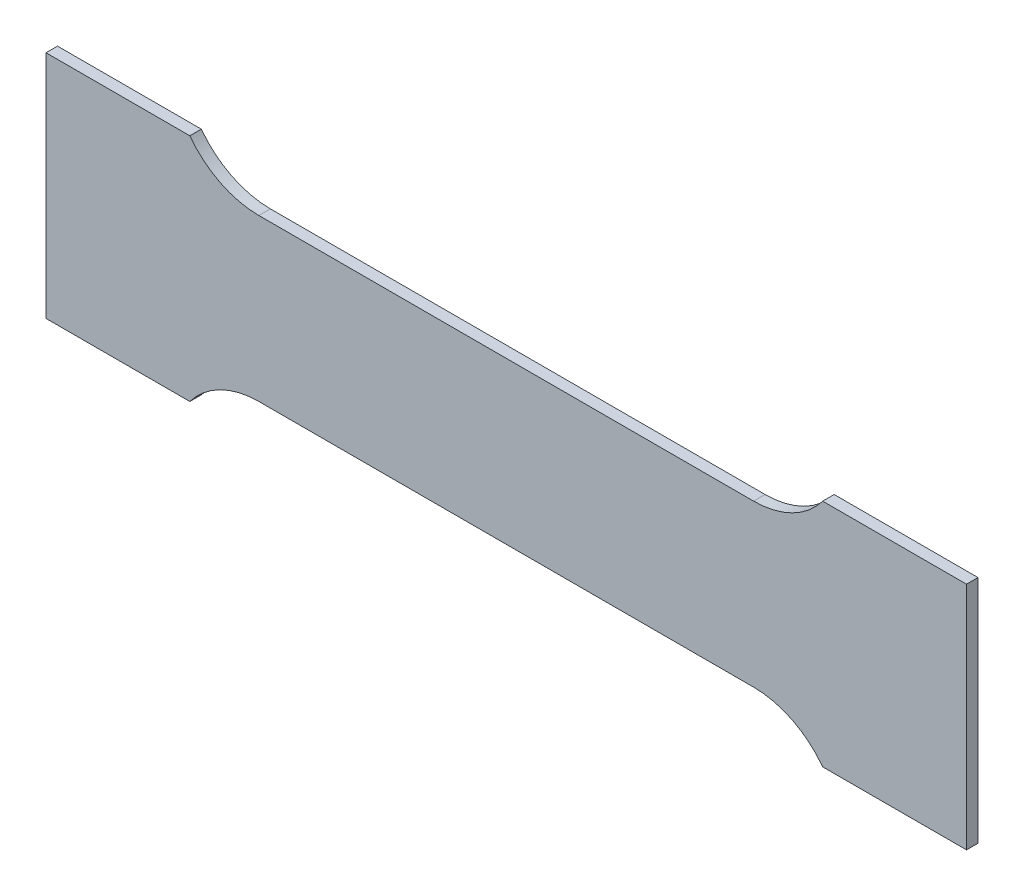
ISO-10303-21;
HEADER;
FILE_DESCRIPTION(('STEP AP214'),'2;1');
FILE_NAME('part.step','',(''),(''),'','','');
FILE_SCHEMA(('AUTOMOTIVE_DESIGN { 1 0 10303 214 1 1 1 1 }'));
ENDSEC;
DATA;
#1=APPLICATION_CONTEXT('core data for automotive mechanical design processes');
#2=APPLICATION_PROTOCOL_DEFINITION('international standard','automotive_design',2000,#1);
#3=PRODUCT_CONTEXT('',#1,'mechanical');
#4=PRODUCT('Part','Part','',(#3));
#5=PRODUCT_RELATED_PRODUCT_CATEGORY('part','',(#4));
#6=PRODUCT_DEFINITION_FORMATION('','',#4);
#7=PRODUCT_DEFINITION_CONTEXT('part definition',#1,'design');
#8=PRODUCT_DEFINITION('design','',#6,#7);
#9=PRODUCT_DEFINITION_SHAPE('','',#8);
#10=(LENGTH_UNIT() NAMED_UNIT(*) SI_UNIT(.MILLI.,.METRE.));
#11=(NAMED_UNIT(*) PLANE_ANGLE_UNIT() SI_UNIT($,.RADIAN.));
#12=(NAMED_UNIT(*) SI_UNIT($,.STERADIAN.) SOLID_ANGLE_UNIT());
#13=UNCERTAINTY_MEASURE_WITH_UNIT(LENGTH_MEASURE(1.E-05),#10,'distance_accuracy_value','');
#14=(GEOMETRIC_REPRESENTATION_CONTEXT(3) GLOBAL_UNCERTAINTY_ASSIGNED_CONTEXT((#13)) GLOBAL_UNIT_ASSIGNED_CONTEXT((#10,
#11,#12)) REPRESENTATION_CONTEXT('',''));
#15=CARTESIAN_POINT('',(0.,0.,0.));
#16=DIRECTION('',(0.,0.,1.));
#17=DIRECTION('',(1.,0.,0.));
#18=AXIS2_PLACEMENT_3D('',#15,#16,#17);
#19=CARTESIAN_POINT('',(43.,29.,-2.));
#20=DIRECTION('',(0.,0.,1.));
#21=DIRECTION('',(1.,0.,0.));
#22=AXIS2_PLACEMENT_3D('',#19,#20,#21);
#23=CYLINDRICAL_SURFACE('',#22,15.);
#24=CARTESIAN_POINT('',(43.,29.,0.));
#25=DIRECTION('',(0.,0.,-1.));
#26=DIRECTION('',(1.,0.,0.));
#27=AXIS2_PLACEMENT_3D('',#24,#25,#26);
#28=CIRCLE('',#27,15.);
#29=CARTESIAN_POINT('',(55.,20.,0.));
#30=VERTEX_POINT('',#29);
#31=CARTESIAN_POINT('',(43.,14.,0.));
#32=VERTEX_POINT('',#31);
#33=EDGE_CURVE('E158',#30,#32,#28,.T.);
#34=ORIENTED_EDGE('',*,*,#33,.F.);
#35=DIRECTION('',(0.,0.,1.));
#36=VECTOR('',#35,1.);
#37=CARTESIAN_POINT('',(55.,20.,-2.));
#38=LINE('',#37,#36);
#39=CARTESIAN_POINT('',(55.,20.,-2.));
#40=VERTEX_POINT('',#39);
#41=EDGE_CURVE('E11',#40,#30,#38,.T.);
#42=ORIENTED_EDGE('',*,*,#41,.F.);
#43=CARTESIAN_POINT('',(43.,29.,-2.));
#44=DIRECTION('',(0.,0.,-1.));
#45=DIRECTION('',(1.,0.,0.));
#46=AXIS2_PLACEMENT_3D('',#43,#44,#45);
#47=CIRCLE('',#46,15.);
#48=CARTESIAN_POINT('',(43.,14.,-2.));
#49=VERTEX_POINT('',#48);
#50=EDGE_CURVE('E190',#40,#49,#47,.T.);
#51=ORIENTED_EDGE('',*,*,#50,.T.);
#52=DIRECTION('',(0.,0.,1.));
#53=VECTOR('',#52,1.);
#54=CARTESIAN_POINT('',(43.,14.,-2.));
#55=LINE('',#54,#53);
#56=EDGE_CURVE('E40',#49,#32,#55,.T.);
#57=ORIENTED_EDGE('',*,*,#56,.T.);
#58=EDGE_LOOP('',(#34,#42,#51,#57));
#59=FACE_BOUND('',#58,.T.);
#60=ADVANCED_FACE('F37',(#59),#23,.F.);
#61=CARTESIAN_POINT('',(55.,20.,-2.));
#62=DIRECTION('',(0.,1.,0.));
#63=DIRECTION('',(0.,0.,1.));
#64=AXIS2_PLACEMENT_3D('',#61,#62,#63);
#65=PLANE('',#64);
#66=DIRECTION('',(-1.,0.,0.));
#67=VECTOR('',#66,1.);
#68=CARTESIAN_POINT('',(55.,20.,0.));
#69=LINE('',#68,#67);
#70=CARTESIAN_POINT('',(80.,20.,0.));
#71=VERTEX_POINT('',#70);
#72=EDGE_CURVE('E188',#71,#30,#69,.T.);
#73=ORIENTED_EDGE('',*,*,#72,.F.);
#74=DIRECTION('',(0.,0.,1.));
#75=VECTOR('',#74,1.);
#76=CARTESIAN_POINT('',(80.,20.,-2.));
#77=LINE('',#76,#75);
#78=CARTESIAN_POINT('',(80.,20.,-2.));
#79=VERTEX_POINT('',#78);
#80=EDGE_CURVE('E46',#79,#71,#77,.T.);
#81=ORIENTED_EDGE('',*,*,#80,.F.);
#82=DIRECTION('',(-1.,0.,0.));
#83=VECTOR('',#82,1.);
#84=CARTESIAN_POINT('',(55.,20.,-2.));
#85=LINE('',#84,#83);
#86=EDGE_CURVE('E148',#79,#40,#85,.T.);
#87=ORIENTED_EDGE('',*,*,#86,.T.);
#88=ORIENTED_EDGE('',*,*,#41,.T.);
#89=EDGE_LOOP('',(#73,#81,#87,#88));
#90=FACE_BOUND('',#89,.T.);
#91=ADVANCED_FACE('F210',(#90),#65,.T.);
#92=CARTESIAN_POINT('',(80.,20.,-2.));
#93=DIRECTION('',(1.,0.,0.));
#94=DIRECTION('',(0.,1.,0.));
#95=AXIS2_PLACEMENT_3D('',#92,#93,#94);
#96=PLANE('',#95);
#97=DIRECTION('',(0.,1.,0.));
#98=VECTOR('',#97,1.);
#99=CARTESIAN_POINT('',(80.,20.,0.));
#100=LINE('',#99,#98);
#101=CARTESIAN_POINT('',(79.9999999999999,-20.,0.));
#102=VERTEX_POINT('',#101);
#103=EDGE_CURVE('E135',#102,#71,#100,.T.);
#104=ORIENTED_EDGE('',*,*,#103,.F.);
#105=DIRECTION('',(0.,0.,1.));
#106=VECTOR('',#105,1.);
#107=CARTESIAN_POINT('',(79.9999999999999,-20.,-2.));
#108=LINE('',#107,#106);
#109=CARTESIAN_POINT('',(79.9999999999999,-20.,-2.));
#110=VERTEX_POINT('',#109);
#111=EDGE_CURVE('E130',#110,#102,#108,.T.);
#112=ORIENTED_EDGE('',*,*,#111,.F.);
#113=DIRECTION('',(0.,1.,0.));
#114=VECTOR('',#113,1.);
#115=CARTESIAN_POINT('',(80.,20.,-2.));
#116=LINE('',#115,#114);
#117=EDGE_CURVE('E133',#110,#79,#116,.T.);
#118=ORIENTED_EDGE('',*,*,#117,.T.);
#119=ORIENTED_EDGE('',*,*,#80,.T.);
#120=EDGE_LOOP('',(#104,#112,#118,#119));
#121=FACE_BOUND('',#120,.T.);
#122=ADVANCED_FACE('F132',(#121),#96,.T.);
#123=CARTESIAN_POINT('',(54.9999999999999,-20.,-2.));
#124=DIRECTION('',(0.,-1.,0.));
#125=DIRECTION('',(0.,0.,-1.));
#126=AXIS2_PLACEMENT_3D('',#123,#124,#125);
#127=PLANE('',#126);
#128=DIRECTION('',(1.,0.,0.));
#129=VECTOR('',#128,1.);
#130=CARTESIAN_POINT('',(54.9999999999999,-20.,0.));
#131=LINE('',#130,#129);
#132=CARTESIAN_POINT('',(54.9999999999999,-20.,0.));
#133=VERTEX_POINT('',#132);
#134=EDGE_CURVE('E185',#133,#102,#131,.T.);
#135=ORIENTED_EDGE('',*,*,#134,.F.);
#136=DIRECTION('',(0.,0.,1.));
#137=VECTOR('',#136,1.);
#138=CARTESIAN_POINT('',(54.9999999999999,-20.,-2.));
#139=LINE('',#138,#137);
#140=CARTESIAN_POINT('',(54.9999999999999,-20.,-2.));
#141=VERTEX_POINT('',#140);
#142=EDGE_CURVE('E140',#141,#133,#139,.T.);
#143=ORIENTED_EDGE('',*,*,#142,.F.);
#144=DIRECTION('',(1.,0.,0.));
#145=VECTOR('',#144,1.);
#146=CARTESIAN_POINT('',(54.9999999999999,-20.,-2.));
#147=LINE('',#146,#145);
#148=EDGE_CURVE('E146',#141,#110,#147,.T.);
#149=ORIENTED_EDGE('',*,*,#148,.T.);
#150=ORIENTED_EDGE('',*,*,#111,.T.);
#151=EDGE_LOOP('',(#135,#143,#149,#150));
#152=FACE_BOUND('',#151,.T.);
#153=ADVANCED_FACE('F150',(#152),#127,.T.);
#154=CARTESIAN_POINT('',(42.9999999999999,-29.,-2.));
#155=DIRECTION('',(0.,0.,1.));
#156=DIRECTION('',(1.,0.,0.));
#157=AXIS2_PLACEMENT_3D('',#154,#155,#156);
#158=CYLINDRICAL_SURFACE('',#157,15.);
#159=CARTESIAN_POINT('',(42.9999999999999,-29.,0.));
#160=DIRECTION('',(0.,0.,-1.));
#161=DIRECTION('',(-1.,0.,0.));
#162=AXIS2_PLACEMENT_3D('',#159,#160,#161);
#163=CIRCLE('',#162,15.);
#164=CARTESIAN_POINT('',(42.9999999999999,-14.,0.));
#165=VERTEX_POINT('',#164);
#166=EDGE_CURVE('E182',#165,#133,#163,.T.);
#167=ORIENTED_EDGE('',*,*,#166,.F.);
#168=DIRECTION('',(0.,0.,1.));
#169=VECTOR('',#168,1.);
#170=CARTESIAN_POINT('',(42.9999999999999,-14.,-2.));
#171=LINE('',#170,#169);
#172=CARTESIAN_POINT('',(42.9999999999999,-14.,-2.));
#173=VERTEX_POINT('',#172);
#174=EDGE_CURVE('E194',#173,#165,#171,.T.);
#175=ORIENTED_EDGE('',*,*,#174,.F.);
#176=CARTESIAN_POINT('',(42.9999999999999,-29.,-2.));
#177=DIRECTION('',(0.,0.,-1.));
#178=DIRECTION('',(-1.,0.,0.));
#179=AXIS2_PLACEMENT_3D('',#176,#177,#178);
#180=CIRCLE('',#179,15.);
#181=EDGE_CURVE('E151',#173,#141,#180,.T.);
#182=ORIENTED_EDGE('',*,*,#181,.T.);
#183=ORIENTED_EDGE('',*,*,#142,.T.);
#184=EDGE_LOOP('',(#167,#175,#182,#183));
#185=FACE_BOUND('',#184,.T.);
#186=ADVANCED_FACE('F223',(#185),#158,.F.);
#187=CARTESIAN_POINT('',(-43.,-14.,-2.));
#188=DIRECTION('',(0.,-1.,0.));
#189=DIRECTION('',(0.,0.,-1.));
#190=AXIS2_PLACEMENT_3D('',#187,#188,#189);
#191=PLANE('',#190);
#192=DIRECTION('',(1.,0.,0.));
#193=VECTOR('',#192,1.);
#194=CARTESIAN_POINT('',(-43.,-14.,0.));
#195=LINE('',#194,#193);
#196=CARTESIAN_POINT('',(-43.,-14.,0.));
#197=VERTEX_POINT('',#196);
#198=EDGE_CURVE('E179',#197,#165,#195,.T.);
#199=ORIENTED_EDGE('',*,*,#198,.F.);
#200=DIRECTION('',(0.,0.,1.));
#201=VECTOR('',#200,1.);
#202=CARTESIAN_POINT('',(-43.,-14.,-2.));
#203=LINE('',#202,#201);
#204=CARTESIAN_POINT('',(-43.,-14.,-2.));
#205=VERTEX_POINT('',#204);
#206=EDGE_CURVE('E196',#205,#197,#203,.T.);
#207=ORIENTED_EDGE('',*,*,#206,.F.);
#208=DIRECTION('',(1.,0.,0.));
#209=VECTOR('',#208,1.);
#210=CARTESIAN_POINT('',(-43.,-14.,-2.));
#211=LINE('',#210,#209);
#212=EDGE_CURVE('E153',#205,#173,#211,.T.);
#213=ORIENTED_EDGE('',*,*,#212,.T.);
#214=ORIENTED_EDGE('',*,*,#174,.T.);
#215=EDGE_LOOP('',(#199,#207,#213,#214));
#216=FACE_BOUND('',#215,.T.);
#217=ADVANCED_FACE('F226',(#216),#191,.T.);
#218=CARTESIAN_POINT('',(-43.,-29.,-2.));
#219=DIRECTION('',(0.,0.,1.));
#220=DIRECTION('',(1.,0.,0.));
#221=AXIS2_PLACEMENT_3D('',#218,#219,#220);
#222=CYLINDRICAL_SURFACE('',#221,15.);
#223=CARTESIAN_POINT('',(-43.,-29.,0.));
#224=DIRECTION('',(0.,0.,-1.));
#225=DIRECTION('',(1.,0.,0.));
#226=AXIS2_PLACEMENT_3D('',#223,#224,#225);
#227=CIRCLE('',#226,15.);
#228=CARTESIAN_POINT('',(-55.,-20.,0.));
#229=VERTEX_POINT('',#228);
#230=EDGE_CURVE('E176',#229,#197,#227,.T.);
#231=ORIENTED_EDGE('',*,*,#230,.F.);
#232=DIRECTION('',(0.,0.,1.));
#233=VECTOR('',#232,1.);
#234=CARTESIAN_POINT('',(-55.,-20.,-2.));
#235=LINE('',#234,#233);
#236=CARTESIAN_POINT('',(-55.,-20.,-2.));
#237=VERTEX_POINT('',#236);
#238=EDGE_CURVE('E198',#237,#229,#235,.T.);
#239=ORIENTED_EDGE('',*,*,#238,.F.);
#240=CARTESIAN_POINT('',(-43.,-29.,-2.));
#241=DIRECTION('',(0.,0.,-1.));
#242=DIRECTION('',(1.,0.,0.));
#243=AXIS2_PLACEMENT_3D('',#240,#241,#242);
#244=CIRCLE('',#243,15.);
#245=EDGE_CURVE('E380',#237,#205,#244,.T.);
#246=ORIENTED_EDGE('',*,*,#245,.T.);
#247=ORIENTED_EDGE('',*,*,#206,.T.);
#248=EDGE_LOOP('',(#231,#239,#246,#247));
#249=FACE_BOUND('',#248,.T.);
#250=ADVANCED_FACE('F230',(#249),#222,.F.);
#251=CARTESIAN_POINT('',(-55.,-20.,-2.));
#252=DIRECTION('',(0.,-1.,0.));
#253=DIRECTION('',(0.,0.,-1.));
#254=AXIS2_PLACEMENT_3D('',#251,#252,#253);
#255=PLANE('',#254);
#256=DIRECTION('',(1.,0.,0.));
#257=VECTOR('',#256,1.);
#258=CARTESIAN_POINT('',(-55.,-20.,0.));
#259=LINE('',#258,#257);
#260=CARTESIAN_POINT('',(-80.,-20.,0.));
#261=VERTEX_POINT('',#260);
#262=EDGE_CURVE('E173',#261,#229,#259,.T.);
#263=ORIENTED_EDGE('',*,*,#262,.F.);
#264=DIRECTION('',(0.,0.,1.));
#265=VECTOR('',#264,1.);
#266=CARTESIAN_POINT('',(-80.,-20.,-2.));
#267=LINE('',#266,#265);
#268=CARTESIAN_POINT('',(-80.,-20.,-2.));
#269=VERTEX_POINT('',#268);
#270=EDGE_CURVE('E200',#269,#261,#267,.T.);
#271=ORIENTED_EDGE('',*,*,#270,.F.);
#272=DIRECTION('',(1.,0.,0.));
#273=VECTOR('',#272,1.);
#274=CARTESIAN_POINT('',(-55.,-20.,-2.));
#275=LINE('',#274,#273);
#276=EDGE_CURVE('E384',#269,#237,#275,.T.);
#277=ORIENTED_EDGE('',*,*,#276,.T.);
#278=ORIENTED_EDGE('',*,*,#238,.T.);
#279=EDGE_LOOP('',(#263,#271,#277,#278));
#280=FACE_BOUND('',#279,.T.);
#281=ADVANCED_FACE('F234',(#280),#255,.T.);
#282=CARTESIAN_POINT('',(-80.,20.,-2.));
#283=DIRECTION('',(-1.,0.,0.));
#284=DIRECTION('',(0.,0.,1.));
#285=AXIS2_PLACEMENT_3D('',#282,#283,#284);
#286=PLANE('',#285);
#287=DIRECTION('',(0.,-1.,0.));
#288=VECTOR('',#287,1.);
#289=CARTESIAN_POINT('',(-80.,20.,0.));
#290=LINE('',#289,#288);
#291=CARTESIAN_POINT('',(-80.,20.,0.));
#292=VERTEX_POINT('',#291);
#293=EDGE_CURVE('E170',#292,#261,#290,.T.);
#294=ORIENTED_EDGE('',*,*,#293,.F.);
#295=DIRECTION('',(0.,0.,1.));
#296=VECTOR('',#295,1.);
#297=CARTESIAN_POINT('',(-80.,20.,-2.));
#298=LINE('',#297,#296);
#299=CARTESIAN_POINT('',(-80.,20.,-2.));
#300=VERTEX_POINT('',#299);
#301=EDGE_CURVE('E202',#300,#292,#298,.T.);
#302=ORIENTED_EDGE('',*,*,#301,.F.);
#303=DIRECTION('',(0.,-1.,0.));
#304=VECTOR('',#303,1.);
#305=CARTESIAN_POINT('',(-80.,20.,-2.));
#306=LINE('',#305,#304);
#307=EDGE_CURVE('E373',#300,#269,#306,.T.);
#308=ORIENTED_EDGE('',*,*,#307,.T.);
#309=ORIENTED_EDGE('',*,*,#270,.T.);
#310=EDGE_LOOP('',(#294,#302,#308,#309));
#311=FACE_BOUND('',#310,.T.);
#312=ADVANCED_FACE('F238',(#311),#286,.T.);
#313=CARTESIAN_POINT('',(-55.,20.,-2.));
#314=DIRECTION('',(0.,1.,0.));
#315=DIRECTION('',(0.,0.,1.));
#316=AXIS2_PLACEMENT_3D('',#313,#314,#315);
#317=PLANE('',#316);
#318=DIRECTION('',(-1.,0.,0.));
#319=VECTOR('',#318,1.);
#320=CARTESIAN_POINT('',(-55.,20.,0.));
#321=LINE('',#320,#319);
#322=CARTESIAN_POINT('',(-55.,20.,0.));
#323=VERTEX_POINT('',#322);
#324=EDGE_CURVE('E167',#323,#292,#321,.T.);
#325=ORIENTED_EDGE('',*,*,#324,.F.);
#326=DIRECTION('',(0.,0.,1.));
#327=VECTOR('',#326,1.);
#328=CARTESIAN_POINT('',(-55.,20.,-2.));
#329=LINE('',#328,#327);
#330=CARTESIAN_POINT('',(-55.,20.,-2.));
#331=VERTEX_POINT('',#330);
#332=EDGE_CURVE('E204',#331,#323,#329,.T.);
#333=ORIENTED_EDGE('',*,*,#332,.F.);
#334=DIRECTION('',(-1.,0.,0.));
#335=VECTOR('',#334,1.);
#336=CARTESIAN_POINT('',(-55.,20.,-2.));
#337=LINE('',#336,#335);
#338=EDGE_CURVE('E369',#331,#300,#337,.T.);
#339=ORIENTED_EDGE('',*,*,#338,.T.);
#340=ORIENTED_EDGE('',*,*,#301,.T.);
#341=EDGE_LOOP('',(#325,#333,#339,#340));
#342=FACE_BOUND('',#341,.T.);
#343=ADVANCED_FACE('F242',(#342),#317,.T.);
#344=CARTESIAN_POINT('',(-43.,29.,-2.));
#345=DIRECTION('',(0.,0.,1.));
#346=DIRECTION('',(1.,0.,0.));
#347=AXIS2_PLACEMENT_3D('',#344,#345,#346);
#348=CYLINDRICAL_SURFACE('',#347,15.);
#349=CARTESIAN_POINT('',(-43.,29.,0.));
#350=DIRECTION('',(0.,0.,-1.));
#351=DIRECTION('',(-1.,0.,0.));
#352=AXIS2_PLACEMENT_3D('',#349,#350,#351);
#353=CIRCLE('',#352,15.);
#354=CARTESIAN_POINT('',(-43.,14.,0.));
#355=VERTEX_POINT('',#354);
#356=EDGE_CURVE('E164',#355,#323,#353,.T.);
#357=ORIENTED_EDGE('',*,*,#356,.F.);
#358=DIRECTION('',(0.,0.,1.));
#359=VECTOR('',#358,1.);
#360=CARTESIAN_POINT('',(-43.,14.,-2.));
#361=LINE('',#360,#359);
#362=CARTESIAN_POINT('',(-43.,14.,-2.));
#363=VERTEX_POINT('',#362);
#364=EDGE_CURVE('E205',#363,#355,#361,.T.);
#365=ORIENTED_EDGE('',*,*,#364,.F.);
#366=CARTESIAN_POINT('',(-43.,29.,-2.));
#367=DIRECTION('',(0.,0.,-1.));
#368=DIRECTION('',(-1.,0.,0.));
#369=AXIS2_PLACEMENT_3D('',#366,#367,#368);
#370=CIRCLE('',#369,15.);
#371=EDGE_CURVE('E390',#363,#331,#370,.T.);
#372=ORIENTED_EDGE('',*,*,#371,.T.);
#373=ORIENTED_EDGE('',*,*,#332,.T.);
#374=EDGE_LOOP('',(#357,#365,#372,#373));
#375=FACE_BOUND('',#374,.T.);
#376=ADVANCED_FACE('F246',(#375),#348,.F.);
#377=CARTESIAN_POINT('',(-43.,14.,-2.));
#378=DIRECTION('',(0.,1.,0.));
#379=DIRECTION('',(0.,0.,1.));
#380=AXIS2_PLACEMENT_3D('',#377,#378,#379);
#381=PLANE('',#380);
#382=DIRECTION('',(-1.,0.,0.));
#383=VECTOR('',#382,1.);
#384=CARTESIAN_POINT('',(-43.,14.,0.));
#385=LINE('',#384,#383);
#386=EDGE_CURVE('E161',#32,#355,#385,.T.);
#387=ORIENTED_EDGE('',*,*,#386,.F.);
#388=ORIENTED_EDGE('',*,*,#56,.F.);
#389=DIRECTION('',(-1.,0.,0.));
#390=VECTOR('',#389,1.);
#391=CARTESIAN_POINT('',(-43.,14.,-2.));
#392=LINE('',#391,#390);
#393=EDGE_CURVE('E392',#49,#363,#392,.T.);
#394=ORIENTED_EDGE('',*,*,#393,.T.);
#395=ORIENTED_EDGE('',*,*,#364,.T.);
#396=EDGE_LOOP('',(#387,#388,#394,#395));
#397=FACE_BOUND('',#396,.T.);
#398=ADVANCED_FACE('F207',(#397),#381,.T.);
#399=CARTESIAN_POINT('',(43.,29.,-2.));
#400=DIRECTION('',(0.,0.,1.));
#401=DIRECTION('',(1.,0.,0.));
#402=AXIS2_PLACEMENT_3D('',#399,#400,#401);
#403=PLANE('',#402);
#404=ORIENTED_EDGE('',*,*,#50,.F.);
#405=ORIENTED_EDGE('',*,*,#86,.F.);
#406=ORIENTED_EDGE('',*,*,#117,.F.);
#407=ORIENTED_EDGE('',*,*,#148,.F.);
#408=ORIENTED_EDGE('',*,*,#181,.F.);
#409=ORIENTED_EDGE('',*,*,#212,.F.);
#410=ORIENTED_EDGE('',*,*,#245,.F.);
#411=ORIENTED_EDGE('',*,*,#276,.F.);
#412=ORIENTED_EDGE('',*,*,#307,.F.);
#413=ORIENTED_EDGE('',*,*,#338,.F.);
#414=ORIENTED_EDGE('',*,*,#371,.F.);
#415=ORIENTED_EDGE('',*,*,#393,.F.);
#416=EDGE_LOOP('',(#404,#405,#406,#407,#408,#409,#410,#411,#412,#413,#414,#415));
#417=FACE_BOUND('',#416,.T.);
#418=ADVANCED_FACE('F144',(#417),#403,.F.);
#419=CARTESIAN_POINT('',(43.,29.,0.));
#420=DIRECTION('',(0.,0.,1.));
#421=DIRECTION('',(1.,0.,0.));
#422=AXIS2_PLACEMENT_3D('',#419,#420,#421);
#423=PLANE('',#422);
#424=ORIENTED_EDGE('',*,*,#33,.T.);
#425=ORIENTED_EDGE('',*,*,#386,.T.);
#426=ORIENTED_EDGE('',*,*,#356,.T.);
#427=ORIENTED_EDGE('',*,*,#324,.T.);
#428=ORIENTED_EDGE('',*,*,#293,.T.);
#429=ORIENTED_EDGE('',*,*,#262,.T.);
#430=ORIENTED_EDGE('',*,*,#230,.T.);
#431=ORIENTED_EDGE('',*,*,#198,.T.);
#432=ORIENTED_EDGE('',*,*,#166,.T.);
#433=ORIENTED_EDGE('',*,*,#134,.T.);
#434=ORIENTED_EDGE('',*,*,#103,.T.);
#435=ORIENTED_EDGE('',*,*,#72,.T.);
#436=EDGE_LOOP('',(#424,#425,#426,#427,#428,#429,#430,#431,#432,#433,#434,#435));
#437=FACE_BOUND('',#436,.T.);
#438=ADVANCED_FACE('F209',(#437),#423,.T.);
#439=CLOSED_SHELL('',(#60,#91,#122,#153,#186,#217,#250,#281,#312,#343,#376,#398,#418,#438));
#440=MANIFOLD_SOLID_BREP('B2',#439);
#441=ADVANCED_BREP_SHAPE_REPRESENTATION('',(#18,#440),#14);
#442=SHAPE_DEFINITION_REPRESENTATION(#9,#441);
ENDSEC;
END-ISO-10303-21;
